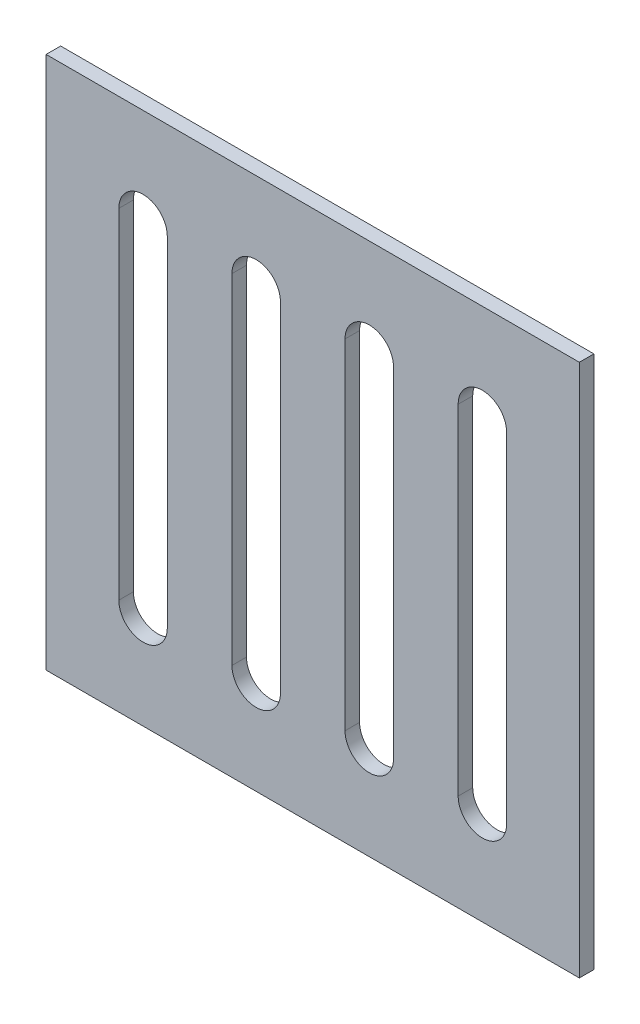
ISO-10303-21;
HEADER;
FILE_DESCRIPTION(('STEP AP214'),'2;1');
FILE_NAME('part.step','',(''),(''),'','','');
FILE_SCHEMA(('AUTOMOTIVE_DESIGN { 1 0 10303 214 1 1 1 1 }'));
ENDSEC;
DATA;
#1=APPLICATION_CONTEXT('core data for automotive mechanical design processes');
#2=APPLICATION_PROTOCOL_DEFINITION('international standard','automotive_design',2000,#1);
#3=PRODUCT_CONTEXT('',#1,'mechanical');
#4=PRODUCT('Part','Part','',(#3));
#5=PRODUCT_RELATED_PRODUCT_CATEGORY('part','',(#4));
#6=PRODUCT_DEFINITION_FORMATION('','',#4);
#7=PRODUCT_DEFINITION_CONTEXT('part definition',#1,'design');
#8=PRODUCT_DEFINITION('design','',#6,#7);
#9=PRODUCT_DEFINITION_SHAPE('','',#8);
#10=(LENGTH_UNIT() NAMED_UNIT(*) SI_UNIT(.MILLI.,.METRE.));
#11=(NAMED_UNIT(*) PLANE_ANGLE_UNIT() SI_UNIT($,.RADIAN.));
#12=(NAMED_UNIT(*) SI_UNIT($,.STERADIAN.) SOLID_ANGLE_UNIT());
#13=UNCERTAINTY_MEASURE_WITH_UNIT(LENGTH_MEASURE(1.E-05),#10,'distance_accuracy_value','');
#14=(GEOMETRIC_REPRESENTATION_CONTEXT(3) GLOBAL_UNCERTAINTY_ASSIGNED_CONTEXT((#13)) GLOBAL_UNIT_ASSIGNED_CONTEXT((#10,
#11,#12)) REPRESENTATION_CONTEXT('',''));
#15=CARTESIAN_POINT('',(0.,0.,0.));
#16=DIRECTION('',(0.,0.,1.));
#17=DIRECTION('',(1.,0.,0.));
#18=AXIS2_PLACEMENT_3D('',#15,#16,#17);
#19=CARTESIAN_POINT('',(0.,0.,3.));
#20=DIRECTION('',(1.,0.,0.));
#21=DIRECTION('',(0.,1.,0.));
#22=AXIS2_PLACEMENT_3D('',#19,#20,#21);
#23=PLANE('',#22);
#24=DIRECTION('',(0.,-1.,0.));
#25=VECTOR('',#24,1.);
#26=CARTESIAN_POINT('',(0.,0.,0.));
#27=LINE('',#26,#25);
#28=CARTESIAN_POINT('',(0.,0.,0.));
#29=VERTEX_POINT('',#28);
#30=CARTESIAN_POINT('',(0.,-110.,0.));
#31=VERTEX_POINT('',#30);
#32=EDGE_CURVE('E211',#29,#31,#27,.T.);
#33=ORIENTED_EDGE('',*,*,#32,.T.);
#34=DIRECTION('',(0.,0.,-1.));
#35=VECTOR('',#34,1.);
#36=CARTESIAN_POINT('',(0.,-110.,3.));
#37=LINE('',#36,#35);
#38=CARTESIAN_POINT('',(0.,-110.,3.));
#39=VERTEX_POINT('',#38);
#40=EDGE_CURVE('E335',#39,#31,#37,.T.);
#41=ORIENTED_EDGE('',*,*,#40,.F.);
#42=DIRECTION('',(0.,-1.,0.));
#43=VECTOR('',#42,1.);
#44=CARTESIAN_POINT('',(0.,0.,3.));
#45=LINE('',#44,#43);
#46=CARTESIAN_POINT('',(0.,0.,3.));
#47=VERTEX_POINT('',#46);
#48=EDGE_CURVE('E298',#47,#39,#45,.T.);
#49=ORIENTED_EDGE('',*,*,#48,.F.);
#50=DIRECTION('',(0.,0.,-1.));
#51=VECTOR('',#50,1.);
#52=CARTESIAN_POINT('',(0.,0.,3.));
#53=LINE('',#52,#51);
#54=EDGE_CURVE('E312',#47,#29,#53,.T.);
#55=ORIENTED_EDGE('',*,*,#54,.T.);
#56=EDGE_LOOP('',(#33,#41,#49,#55));
#57=FACE_BOUND('',#56,.T.);
#58=ADVANCED_FACE('F38',(#57),#23,.F.);
#59=CARTESIAN_POINT('',(0.,-110.,3.));
#60=DIRECTION('',(0.,1.,0.));
#61=DIRECTION('',(0.,0.,1.));
#62=AXIS2_PLACEMENT_3D('',#59,#60,#61);
#63=PLANE('',#62);
#64=DIRECTION('',(1.,0.,0.));
#65=VECTOR('',#64,1.);
#66=CARTESIAN_POINT('',(0.,-110.,0.));
#67=LINE('',#66,#65);
#68=CARTESIAN_POINT('',(110.,-110.,0.));
#69=VERTEX_POINT('',#68);
#70=EDGE_CURVE('E316',#31,#69,#67,.T.);
#71=ORIENTED_EDGE('',*,*,#70,.T.);
#72=DIRECTION('',(0.,0.,-1.));
#73=VECTOR('',#72,1.);
#74=CARTESIAN_POINT('',(110.,-110.,3.));
#75=LINE('',#74,#73);
#76=CARTESIAN_POINT('',(110.,-110.,3.));
#77=VERTEX_POINT('',#76);
#78=EDGE_CURVE('E331',#77,#69,#75,.T.);
#79=ORIENTED_EDGE('',*,*,#78,.F.);
#80=DIRECTION('',(1.,0.,0.));
#81=VECTOR('',#80,1.);
#82=CARTESIAN_POINT('',(0.,-110.,3.));
#83=LINE('',#82,#81);
#84=EDGE_CURVE('E302',#39,#77,#83,.T.);
#85=ORIENTED_EDGE('',*,*,#84,.F.);
#86=ORIENTED_EDGE('',*,*,#40,.T.);
#87=EDGE_LOOP('',(#71,#79,#85,#86));
#88=FACE_BOUND('',#87,.T.);
#89=ADVANCED_FACE('F414',(#88),#63,.F.);
#90=CARTESIAN_POINT('',(110.,0.,3.));
#91=DIRECTION('',(-1.,0.,0.));
#92=DIRECTION('',(0.,-1.,0.));
#93=AXIS2_PLACEMENT_3D('',#90,#91,#92);
#94=PLANE('',#93);
#95=DIRECTION('',(0.,1.,0.));
#96=VECTOR('',#95,1.);
#97=CARTESIAN_POINT('',(110.,0.,0.));
#98=LINE('',#97,#96);
#99=CARTESIAN_POINT('',(110.,0.,0.));
#100=VERTEX_POINT('',#99);
#101=EDGE_CURVE('E319',#69,#100,#98,.T.);
#102=ORIENTED_EDGE('',*,*,#101,.T.);
#103=DIRECTION('',(0.,0.,-1.));
#104=VECTOR('',#103,1.);
#105=CARTESIAN_POINT('',(110.,0.,3.));
#106=LINE('',#105,#104);
#107=CARTESIAN_POINT('',(110.,0.,3.));
#108=VERTEX_POINT('',#107);
#109=EDGE_CURVE('E327',#108,#100,#106,.T.);
#110=ORIENTED_EDGE('',*,*,#109,.F.);
#111=DIRECTION('',(0.,1.,0.));
#112=VECTOR('',#111,1.);
#113=CARTESIAN_POINT('',(110.,0.,3.));
#114=LINE('',#113,#112);
#115=EDGE_CURVE('E306',#77,#108,#114,.T.);
#116=ORIENTED_EDGE('',*,*,#115,.F.);
#117=ORIENTED_EDGE('',*,*,#78,.T.);
#118=EDGE_LOOP('',(#102,#110,#116,#117));
#119=FACE_BOUND('',#118,.T.);
#120=ADVANCED_FACE('F419',(#119),#94,.F.);
#121=CARTESIAN_POINT('',(0.,0.,3.));
#122=DIRECTION('',(0.,-1.,0.));
#123=DIRECTION('',(0.,0.,-1.));
#124=AXIS2_PLACEMENT_3D('',#121,#122,#123);
#125=PLANE('',#124);
#126=DIRECTION('',(-1.,0.,0.));
#127=VECTOR('',#126,1.);
#128=CARTESIAN_POINT('',(0.,0.,0.));
#129=LINE('',#128,#127);
#130=EDGE_CURVE('E303',#100,#29,#129,.T.);
#131=ORIENTED_EDGE('',*,*,#130,.T.);
#132=ORIENTED_EDGE('',*,*,#54,.F.);
#133=DIRECTION('',(-1.,0.,0.));
#134=VECTOR('',#133,1.);
#135=CARTESIAN_POINT('',(0.,0.,3.));
#136=LINE('',#135,#134);
#137=EDGE_CURVE('E309',#108,#47,#136,.T.);
#138=ORIENTED_EDGE('',*,*,#137,.F.);
#139=ORIENTED_EDGE('',*,*,#109,.T.);
#140=EDGE_LOOP('',(#131,#132,#138,#139));
#141=FACE_BOUND('',#140,.T.);
#142=ADVANCED_FACE('F434',(#141),#125,.F.);
#143=CARTESIAN_POINT('',(0.,0.,3.));
#144=DIRECTION('',(0.,0.,1.));
#145=DIRECTION('',(1.,0.,0.));
#146=AXIS2_PLACEMENT_3D('',#143,#144,#145);
#147=PLANE('',#146);
#148=CARTESIAN_POINT('',(20.,-20.,3.));
#149=DIRECTION('',(0.,0.,1.));
#150=DIRECTION('',(1.,0.,0.));
#151=AXIS2_PLACEMENT_3D('',#148,#149,#150);
#152=CIRCLE('',#151,5.);
#153=CARTESIAN_POINT('',(25.,-20.,3.));
#154=VERTEX_POINT('',#153);
#155=CARTESIAN_POINT('',(15.,-20.,3.));
#156=VERTEX_POINT('',#155);
#157=EDGE_CURVE('E53',#154,#156,#152,.T.);
#158=ORIENTED_EDGE('',*,*,#157,.F.);
#159=DIRECTION('',(0.,1.,0.));
#160=VECTOR('',#159,1.);
#161=CARTESIAN_POINT('',(25.,-20.,3.));
#162=LINE('',#161,#160);
#163=CARTESIAN_POINT('',(25.,-90.,3.));
#164=VERTEX_POINT('',#163);
#165=EDGE_CURVE('E201',#164,#154,#162,.T.);
#166=ORIENTED_EDGE('',*,*,#165,.F.);
#167=CARTESIAN_POINT('',(20.,-90.,3.));
#168=DIRECTION('',(0.,0.,1.));
#169=DIRECTION('',(1.,0.,0.));
#170=AXIS2_PLACEMENT_3D('',#167,#168,#169);
#171=CIRCLE('',#170,5.);
#172=CARTESIAN_POINT('',(15.,-90.,3.));
#173=VERTEX_POINT('',#172);
#174=EDGE_CURVE('E182',#173,#164,#171,.T.);
#175=ORIENTED_EDGE('',*,*,#174,.F.);
#176=DIRECTION('',(0.,-1.,0.));
#177=VECTOR('',#176,1.);
#178=CARTESIAN_POINT('',(15.,-20.,3.));
#179=LINE('',#178,#177);
#180=EDGE_CURVE('E193',#156,#173,#179,.T.);
#181=ORIENTED_EDGE('',*,*,#180,.F.);
#182=EDGE_LOOP('',(#158,#166,#175,#181));
#183=FACE_BOUND('',#182,.T.);
#184=CARTESIAN_POINT('',(43.3333333333333,-20.,3.));
#185=DIRECTION('',(0.,0.,1.));
#186=DIRECTION('',(1.,0.,0.));
#187=AXIS2_PLACEMENT_3D('',#184,#185,#186);
#188=CIRCLE('',#187,4.99999999999999);
#189=CARTESIAN_POINT('',(48.3333333333333,-20.,3.));
#190=VERTEX_POINT('',#189);
#191=CARTESIAN_POINT('',(38.3333333333333,-20.,3.));
#192=VERTEX_POINT('',#191);
#193=EDGE_CURVE('E61',#190,#192,#188,.T.);
#194=ORIENTED_EDGE('',*,*,#193,.F.);
#195=DIRECTION('',(0.,1.,0.));
#196=VECTOR('',#195,1.);
#197=CARTESIAN_POINT('',(48.3333333333333,-20.,3.));
#198=LINE('',#197,#196);
#199=CARTESIAN_POINT('',(48.3333333333333,-90.,3.));
#200=VERTEX_POINT('',#199);
#201=EDGE_CURVE('E227',#200,#190,#198,.T.);
#202=ORIENTED_EDGE('',*,*,#201,.F.);
#203=CARTESIAN_POINT('',(43.3333333333333,-90.,3.));
#204=DIRECTION('',(0.,0.,1.));
#205=DIRECTION('',(1.,0.,0.));
#206=AXIS2_PLACEMENT_3D('',#203,#204,#205);
#207=CIRCLE('',#206,4.99999999999999);
#208=CARTESIAN_POINT('',(38.3333333333334,-90.,3.));
#209=VERTEX_POINT('',#208);
#210=EDGE_CURVE('E223',#209,#200,#207,.T.);
#211=ORIENTED_EDGE('',*,*,#210,.F.);
#212=DIRECTION('',(0.,-1.,0.));
#213=VECTOR('',#212,1.);
#214=CARTESIAN_POINT('',(38.3333333333333,-20.,3.));
#215=LINE('',#214,#213);
#216=EDGE_CURVE('E218',#192,#209,#215,.T.);
#217=ORIENTED_EDGE('',*,*,#216,.F.);
#218=EDGE_LOOP('',(#194,#202,#211,#217));
#219=FACE_BOUND('',#218,.T.);
#220=CARTESIAN_POINT('',(66.6666666666667,-20.,3.));
#221=DIRECTION('',(0.,0.,1.));
#222=DIRECTION('',(1.,0.,0.));
#223=AXIS2_PLACEMENT_3D('',#220,#221,#222);
#224=CIRCLE('',#223,5.);
#225=CARTESIAN_POINT('',(71.6666666666667,-20.,3.));
#226=VERTEX_POINT('',#225);
#227=CARTESIAN_POINT('',(61.6666666666667,-20.,3.));
#228=VERTEX_POINT('',#227);
#229=EDGE_CURVE('E243',#226,#228,#224,.T.);
#230=ORIENTED_EDGE('',*,*,#229,.F.);
#231=DIRECTION('',(0.,1.,0.));
#232=VECTOR('',#231,1.);
#233=CARTESIAN_POINT('',(71.6666666666667,-20.,3.));
#234=LINE('',#233,#232);
#235=CARTESIAN_POINT('',(71.6666666666667,-90.,3.));
#236=VERTEX_POINT('',#235);
#237=EDGE_CURVE('E255',#236,#226,#234,.T.);
#238=ORIENTED_EDGE('',*,*,#237,.F.);
#239=CARTESIAN_POINT('',(66.6666666666667,-90.,3.));
#240=DIRECTION('',(0.,0.,1.));
#241=DIRECTION('',(1.,0.,0.));
#242=AXIS2_PLACEMENT_3D('',#239,#240,#241);
#243=CIRCLE('',#242,5.);
#244=CARTESIAN_POINT('',(61.6666666666667,-90.,3.));
#245=VERTEX_POINT('',#244);
#246=EDGE_CURVE('E251',#245,#236,#243,.T.);
#247=ORIENTED_EDGE('',*,*,#246,.F.);
#248=DIRECTION('',(0.,-1.,0.));
#249=VECTOR('',#248,1.);
#250=CARTESIAN_POINT('',(61.6666666666667,-20.,3.));
#251=LINE('',#250,#249);
#252=EDGE_CURVE('E246',#228,#245,#251,.T.);
#253=ORIENTED_EDGE('',*,*,#252,.F.);
#254=EDGE_LOOP('',(#230,#238,#247,#253));
#255=FACE_BOUND('',#254,.T.);
#256=CARTESIAN_POINT('',(90.,-20.,3.));
#257=DIRECTION('',(0.,0.,1.));
#258=DIRECTION('',(1.,0.,0.));
#259=AXIS2_PLACEMENT_3D('',#256,#257,#258);
#260=CIRCLE('',#259,5.);
#261=CARTESIAN_POINT('',(95.,-20.,3.));
#262=VERTEX_POINT('',#261);
#263=CARTESIAN_POINT('',(85.,-20.,3.));
#264=VERTEX_POINT('',#263);
#265=EDGE_CURVE('E271',#262,#264,#260,.T.);
#266=ORIENTED_EDGE('',*,*,#265,.F.);
#267=DIRECTION('',(0.,1.,0.));
#268=VECTOR('',#267,1.);
#269=CARTESIAN_POINT('',(95.,-20.,3.));
#270=LINE('',#269,#268);
#271=CARTESIAN_POINT('',(95.,-90.,3.));
#272=VERTEX_POINT('',#271);
#273=EDGE_CURVE('E282',#272,#262,#270,.T.);
#274=ORIENTED_EDGE('',*,*,#273,.F.);
#275=CARTESIAN_POINT('',(90.,-90.,3.));
#276=DIRECTION('',(0.,0.,1.));
#277=DIRECTION('',(1.,0.,0.));
#278=AXIS2_PLACEMENT_3D('',#275,#276,#277);
#279=CIRCLE('',#278,5.);
#280=CARTESIAN_POINT('',(85.,-90.,3.));
#281=VERTEX_POINT('',#280);
#282=EDGE_CURVE('E278',#281,#272,#279,.T.);
#283=ORIENTED_EDGE('',*,*,#282,.F.);
#284=DIRECTION('',(0.,-1.,0.));
#285=VECTOR('',#284,1.);
#286=CARTESIAN_POINT('',(85.,-20.,3.));
#287=LINE('',#286,#285);
#288=EDGE_CURVE('E274',#264,#281,#287,.T.);
#289=ORIENTED_EDGE('',*,*,#288,.F.);
#290=EDGE_LOOP('',(#266,#274,#283,#289));
#291=FACE_BOUND('',#290,.T.);
#292=ORIENTED_EDGE('',*,*,#48,.T.);
#293=ORIENTED_EDGE('',*,*,#84,.T.);
#294=ORIENTED_EDGE('',*,*,#115,.T.);
#295=ORIENTED_EDGE('',*,*,#137,.T.);
#296=EDGE_LOOP('',(#292,#293,#294,#295));
#297=FACE_BOUND('',#296,.T.);
#298=ADVANCED_FACE('F198',(#183,#219,#255,#291,#297),#147,.T.);
#299=CARTESIAN_POINT('',(0.,0.,0.));
#300=DIRECTION('',(0.,0.,1.));
#301=DIRECTION('',(1.,0.,0.));
#302=AXIS2_PLACEMENT_3D('',#299,#300,#301);
#303=PLANE('',#302);
#304=DIRECTION('',(0.,1.,0.));
#305=VECTOR('',#304,1.);
#306=CARTESIAN_POINT('',(25.,0.,0.));
#307=LINE('',#306,#305);
#308=CARTESIAN_POINT('',(25.,-90.,0.));
#309=VERTEX_POINT('',#308);
#310=CARTESIAN_POINT('',(25.,-20.,0.));
#311=VERTEX_POINT('',#310);
#312=EDGE_CURVE('E46',#309,#311,#307,.T.);
#313=ORIENTED_EDGE('',*,*,#312,.T.);
#314=CARTESIAN_POINT('',(20.,-20.,0.));
#315=DIRECTION('',(0.,0.,1.));
#316=DIRECTION('',(1.,0.,0.));
#317=AXIS2_PLACEMENT_3D('',#314,#315,#316);
#318=CIRCLE('',#317,5.);
#319=CARTESIAN_POINT('',(15.,-20.,0.));
#320=VERTEX_POINT('',#319);
#321=EDGE_CURVE('E11',#311,#320,#318,.T.);
#322=ORIENTED_EDGE('',*,*,#321,.T.);
#323=DIRECTION('',(0.,-1.,0.));
#324=VECTOR('',#323,1.);
#325=CARTESIAN_POINT('',(15.,0.,0.));
#326=LINE('',#325,#324);
#327=CARTESIAN_POINT('',(15.,-90.,0.));
#328=VERTEX_POINT('',#327);
#329=EDGE_CURVE('E387',#320,#328,#326,.T.);
#330=ORIENTED_EDGE('',*,*,#329,.T.);
#331=CARTESIAN_POINT('',(20.,-90.,0.));
#332=DIRECTION('',(0.,0.,1.));
#333=DIRECTION('',(1.,0.,0.));
#334=AXIS2_PLACEMENT_3D('',#331,#332,#333);
#335=CIRCLE('',#334,5.);
#336=EDGE_CURVE('E185',#328,#309,#335,.T.);
#337=ORIENTED_EDGE('',*,*,#336,.T.);
#338=EDGE_LOOP('',(#313,#322,#330,#337));
#339=FACE_BOUND('',#338,.T.);
#340=DIRECTION('',(0.,1.,0.));
#341=VECTOR('',#340,1.);
#342=CARTESIAN_POINT('',(48.3333333333333,0.,0.));
#343=LINE('',#342,#341);
#344=CARTESIAN_POINT('',(48.3333333333333,-90.,0.));
#345=VERTEX_POINT('',#344);
#346=CARTESIAN_POINT('',(48.3333333333333,-20.,0.));
#347=VERTEX_POINT('',#346);
#348=EDGE_CURVE('E379',#345,#347,#343,.T.);
#349=ORIENTED_EDGE('',*,*,#348,.T.);
#350=CARTESIAN_POINT('',(43.3333333333333,-20.,0.));
#351=DIRECTION('',(0.,0.,1.));
#352=DIRECTION('',(1.,0.,0.));
#353=AXIS2_PLACEMENT_3D('',#350,#351,#352);
#354=CIRCLE('',#353,4.99999999999999);
#355=CARTESIAN_POINT('',(38.3333333333333,-20.,0.));
#356=VERTEX_POINT('',#355);
#357=EDGE_CURVE('E383',#347,#356,#354,.T.);
#358=ORIENTED_EDGE('',*,*,#357,.T.);
#359=DIRECTION('',(0.,-1.,0.));
#360=VECTOR('',#359,1.);
#361=CARTESIAN_POINT('',(38.3333333333333,0.,0.));
#362=LINE('',#361,#360);
#363=CARTESIAN_POINT('',(38.3333333333333,-90.,0.));
#364=VERTEX_POINT('',#363);
#365=EDGE_CURVE('E371',#356,#364,#362,.T.);
#366=ORIENTED_EDGE('',*,*,#365,.T.);
#367=CARTESIAN_POINT('',(43.3333333333333,-90.,0.));
#368=DIRECTION('',(0.,0.,1.));
#369=DIRECTION('',(1.,0.,0.));
#370=AXIS2_PLACEMENT_3D('',#367,#368,#369);
#371=CIRCLE('',#370,4.99999999999999);
#372=EDGE_CURVE('E375',#364,#345,#371,.T.);
#373=ORIENTED_EDGE('',*,*,#372,.T.);
#374=EDGE_LOOP('',(#349,#358,#366,#373));
#375=FACE_BOUND('',#374,.T.);
#376=DIRECTION('',(0.,1.,0.));
#377=VECTOR('',#376,1.);
#378=CARTESIAN_POINT('',(71.6666666666667,0.,0.));
#379=LINE('',#378,#377);
#380=CARTESIAN_POINT('',(71.6666666666667,-90.,0.));
#381=VERTEX_POINT('',#380);
#382=CARTESIAN_POINT('',(71.6666666666667,-20.,0.));
#383=VERTEX_POINT('',#382);
#384=EDGE_CURVE('E363',#381,#383,#379,.T.);
#385=ORIENTED_EDGE('',*,*,#384,.T.);
#386=CARTESIAN_POINT('',(66.6666666666667,-20.,0.));
#387=DIRECTION('',(0.,0.,1.));
#388=DIRECTION('',(1.,0.,0.));
#389=AXIS2_PLACEMENT_3D('',#386,#387,#388);
#390=CIRCLE('',#389,5.);
#391=CARTESIAN_POINT('',(61.6666666666667,-20.,0.));
#392=VERTEX_POINT('',#391);
#393=EDGE_CURVE('E367',#383,#392,#390,.T.);
#394=ORIENTED_EDGE('',*,*,#393,.T.);
#395=DIRECTION('',(0.,-1.,0.));
#396=VECTOR('',#395,1.);
#397=CARTESIAN_POINT('',(61.6666666666667,0.,0.));
#398=LINE('',#397,#396);
#399=CARTESIAN_POINT('',(61.6666666666667,-90.,0.));
#400=VERTEX_POINT('',#399);
#401=EDGE_CURVE('E355',#392,#400,#398,.T.);
#402=ORIENTED_EDGE('',*,*,#401,.T.);
#403=CARTESIAN_POINT('',(66.6666666666667,-90.,0.));
#404=DIRECTION('',(0.,0.,1.));
#405=DIRECTION('',(1.,0.,0.));
#406=AXIS2_PLACEMENT_3D('',#403,#404,#405);
#407=CIRCLE('',#406,5.);
#408=EDGE_CURVE('E359',#400,#381,#407,.T.);
#409=ORIENTED_EDGE('',*,*,#408,.T.);
#410=EDGE_LOOP('',(#385,#394,#402,#409));
#411=FACE_BOUND('',#410,.T.);
#412=DIRECTION('',(0.,1.,0.));
#413=VECTOR('',#412,1.);
#414=CARTESIAN_POINT('',(95.,0.,0.));
#415=LINE('',#414,#413);
#416=CARTESIAN_POINT('',(95.,-90.,0.));
#417=VERTEX_POINT('',#416);
#418=CARTESIAN_POINT('',(95.,-20.,0.));
#419=VERTEX_POINT('',#418);
#420=EDGE_CURVE('E347',#417,#419,#415,.T.);
#421=ORIENTED_EDGE('',*,*,#420,.T.);
#422=CARTESIAN_POINT('',(90.,-20.,0.));
#423=DIRECTION('',(0.,0.,1.));
#424=DIRECTION('',(1.,0.,0.));
#425=AXIS2_PLACEMENT_3D('',#422,#423,#424);
#426=CIRCLE('',#425,5.);
#427=CARTESIAN_POINT('',(85.,-20.,0.));
#428=VERTEX_POINT('',#427);
#429=EDGE_CURVE('E351',#419,#428,#426,.T.);
#430=ORIENTED_EDGE('',*,*,#429,.T.);
#431=DIRECTION('',(0.,-1.,0.));
#432=VECTOR('',#431,1.);
#433=CARTESIAN_POINT('',(85.,0.,0.));
#434=LINE('',#433,#432);
#435=CARTESIAN_POINT('',(85.,-90.,0.));
#436=VERTEX_POINT('',#435);
#437=EDGE_CURVE('E339',#428,#436,#434,.T.);
#438=ORIENTED_EDGE('',*,*,#437,.T.);
#439=CARTESIAN_POINT('',(90.,-90.,0.));
#440=DIRECTION('',(0.,0.,1.));
#441=DIRECTION('',(1.,0.,0.));
#442=AXIS2_PLACEMENT_3D('',#439,#440,#441);
#443=CIRCLE('',#442,5.);
#444=EDGE_CURVE('E343',#436,#417,#443,.T.);
#445=ORIENTED_EDGE('',*,*,#444,.T.);
#446=EDGE_LOOP('',(#421,#430,#438,#445));
#447=FACE_BOUND('',#446,.T.);
#448=ORIENTED_EDGE('',*,*,#32,.F.);
#449=ORIENTED_EDGE('',*,*,#130,.F.);
#450=ORIENTED_EDGE('',*,*,#101,.F.);
#451=ORIENTED_EDGE('',*,*,#70,.F.);
#452=EDGE_LOOP('',(#448,#449,#450,#451));
#453=FACE_BOUND('',#452,.T.);
#454=ADVANCED_FACE('F394',(#339,#375,#411,#447,#453),#303,.F.);
#455=CARTESIAN_POINT('',(90.,-20.,-7.));
#456=DIRECTION('',(0.,0.,1.));
#457=DIRECTION('',(1.,0.,0.));
#458=AXIS2_PLACEMENT_3D('',#455,#456,#457);
#459=CYLINDRICAL_SURFACE('',#458,5.);
#460=DIRECTION('',(0.,0.,1.));
#461=VECTOR('',#460,1.);
#462=CARTESIAN_POINT('',(95.,-20.,-7.));
#463=LINE('',#462,#461);
#464=EDGE_CURVE('E247',#419,#262,#463,.T.);
#465=ORIENTED_EDGE('',*,*,#464,.T.);
#466=ORIENTED_EDGE('',*,*,#265,.T.);
#467=DIRECTION('',(0.,0.,1.));
#468=VECTOR('',#467,1.);
#469=CARTESIAN_POINT('',(85.,-20.,-7.));
#470=LINE('',#469,#468);
#471=EDGE_CURVE('E286',#428,#264,#470,.T.);
#472=ORIENTED_EDGE('',*,*,#471,.F.);
#473=ORIENTED_EDGE('',*,*,#429,.F.);
#474=EDGE_LOOP('',(#465,#466,#472,#473));
#475=FACE_BOUND('',#474,.T.);
#476=ADVANCED_FACE('F445',(#475),#459,.F.);
#477=CARTESIAN_POINT('',(95.,-20.,-7.));
#478=DIRECTION('',(1.,0.,0.));
#479=DIRECTION('',(0.,0.,-1.));
#480=AXIS2_PLACEMENT_3D('',#477,#478,#479);
#481=PLANE('',#480);
#482=DIRECTION('',(0.,0.,1.));
#483=VECTOR('',#482,1.);
#484=CARTESIAN_POINT('',(95.,-90.,-7.));
#485=LINE('',#484,#483);
#486=EDGE_CURVE('E289',#417,#272,#485,.T.);
#487=ORIENTED_EDGE('',*,*,#486,.T.);
#488=ORIENTED_EDGE('',*,*,#273,.T.);
#489=ORIENTED_EDGE('',*,*,#464,.F.);
#490=ORIENTED_EDGE('',*,*,#420,.F.);
#491=EDGE_LOOP('',(#487,#488,#489,#490));
#492=FACE_BOUND('',#491,.T.);
#493=ADVANCED_FACE('F450',(#492),#481,.F.);
#494=CARTESIAN_POINT('',(90.,-90.,-7.));
#495=DIRECTION('',(0.,0.,1.));
#496=DIRECTION('',(1.,0.,0.));
#497=AXIS2_PLACEMENT_3D('',#494,#495,#496);
#498=CYLINDRICAL_SURFACE('',#497,5.);
#499=DIRECTION('',(0.,0.,1.));
#500=VECTOR('',#499,1.);
#501=CARTESIAN_POINT('',(85.,-90.,-7.));
#502=LINE('',#501,#500);
#503=EDGE_CURVE('E292',#436,#281,#502,.T.);
#504=ORIENTED_EDGE('',*,*,#503,.T.);
#505=ORIENTED_EDGE('',*,*,#282,.T.);
#506=ORIENTED_EDGE('',*,*,#486,.F.);
#507=ORIENTED_EDGE('',*,*,#444,.F.);
#508=EDGE_LOOP('',(#504,#505,#506,#507));
#509=FACE_BOUND('',#508,.T.);
#510=ADVANCED_FACE('F456',(#509),#498,.F.);
#511=CARTESIAN_POINT('',(85.,-20.,-7.));
#512=DIRECTION('',(-1.,0.,0.));
#513=DIRECTION('',(0.,0.,1.));
#514=AXIS2_PLACEMENT_3D('',#511,#512,#513);
#515=PLANE('',#514);
#516=ORIENTED_EDGE('',*,*,#471,.T.);
#517=ORIENTED_EDGE('',*,*,#288,.T.);
#518=ORIENTED_EDGE('',*,*,#503,.F.);
#519=ORIENTED_EDGE('',*,*,#437,.F.);
#520=EDGE_LOOP('',(#516,#517,#518,#519));
#521=FACE_BOUND('',#520,.T.);
#522=ADVANCED_FACE('F452',(#521),#515,.F.);
#523=CARTESIAN_POINT('',(66.6666666666667,-20.,-7.));
#524=DIRECTION('',(0.,0.,1.));
#525=DIRECTION('',(1.,0.,0.));
#526=AXIS2_PLACEMENT_3D('',#523,#524,#525);
#527=CYLINDRICAL_SURFACE('',#526,5.);
#528=DIRECTION('',(0.,0.,1.));
#529=VECTOR('',#528,1.);
#530=CARTESIAN_POINT('',(71.6666666666667,-20.,-7.));
#531=LINE('',#530,#529);
#532=EDGE_CURVE('E219',#383,#226,#531,.T.);
#533=ORIENTED_EDGE('',*,*,#532,.T.);
#534=ORIENTED_EDGE('',*,*,#229,.T.);
#535=DIRECTION('',(0.,0.,1.));
#536=VECTOR('',#535,1.);
#537=CARTESIAN_POINT('',(61.6666666666667,-20.,-7.));
#538=LINE('',#537,#536);
#539=EDGE_CURVE('E259',#392,#228,#538,.T.);
#540=ORIENTED_EDGE('',*,*,#539,.F.);
#541=ORIENTED_EDGE('',*,*,#393,.F.);
#542=EDGE_LOOP('',(#533,#534,#540,#541));
#543=FACE_BOUND('',#542,.T.);
#544=ADVANCED_FACE('F455',(#543),#527,.F.);
#545=CARTESIAN_POINT('',(71.6666666666667,-20.,-7.));
#546=DIRECTION('',(1.,0.,0.));
#547=DIRECTION('',(0.,0.,-1.));
#548=AXIS2_PLACEMENT_3D('',#545,#546,#547);
#549=PLANE('',#548);
#550=DIRECTION('',(0.,0.,1.));
#551=VECTOR('',#550,1.);
#552=CARTESIAN_POINT('',(71.6666666666667,-90.,-7.));
#553=LINE('',#552,#551);
#554=EDGE_CURVE('E262',#381,#236,#553,.T.);
#555=ORIENTED_EDGE('',*,*,#554,.T.);
#556=ORIENTED_EDGE('',*,*,#237,.T.);
#557=ORIENTED_EDGE('',*,*,#532,.F.);
#558=ORIENTED_EDGE('',*,*,#384,.F.);
#559=EDGE_LOOP('',(#555,#556,#557,#558));
#560=FACE_BOUND('',#559,.T.);
#561=ADVANCED_FACE('F466',(#560),#549,.F.);
#562=CARTESIAN_POINT('',(66.6666666666667,-90.,-7.));
#563=DIRECTION('',(0.,0.,1.));
#564=DIRECTION('',(1.,0.,0.));
#565=AXIS2_PLACEMENT_3D('',#562,#563,#564);
#566=CYLINDRICAL_SURFACE('',#565,5.);
#567=DIRECTION('',(0.,0.,1.));
#568=VECTOR('',#567,1.);
#569=CARTESIAN_POINT('',(61.6666666666667,-90.,-7.));
#570=LINE('',#569,#568);
#571=EDGE_CURVE('E265',#400,#245,#570,.T.);
#572=ORIENTED_EDGE('',*,*,#571,.T.);
#573=ORIENTED_EDGE('',*,*,#246,.T.);
#574=ORIENTED_EDGE('',*,*,#554,.F.);
#575=ORIENTED_EDGE('',*,*,#408,.F.);
#576=EDGE_LOOP('',(#572,#573,#574,#575));
#577=FACE_BOUND('',#576,.T.);
#578=ADVANCED_FACE('F472',(#577),#566,.F.);
#579=CARTESIAN_POINT('',(61.6666666666667,-20.,-7.));
#580=DIRECTION('',(-1.,0.,0.));
#581=DIRECTION('',(0.,0.,1.));
#582=AXIS2_PLACEMENT_3D('',#579,#580,#581);
#583=PLANE('',#582);
#584=ORIENTED_EDGE('',*,*,#539,.T.);
#585=ORIENTED_EDGE('',*,*,#252,.T.);
#586=ORIENTED_EDGE('',*,*,#571,.F.);
#587=ORIENTED_EDGE('',*,*,#401,.F.);
#588=EDGE_LOOP('',(#584,#585,#586,#587));
#589=FACE_BOUND('',#588,.T.);
#590=ADVANCED_FACE('F468',(#589),#583,.F.);
#591=CARTESIAN_POINT('',(43.3333333333333,-20.,-7.));
#592=DIRECTION('',(0.,0.,1.));
#593=DIRECTION('',(1.,0.,0.));
#594=AXIS2_PLACEMENT_3D('',#591,#592,#593);
#595=CYLINDRICAL_SURFACE('',#594,4.99999999999999);
#596=DIRECTION('',(0.,0.,1.));
#597=VECTOR('',#596,1.);
#598=CARTESIAN_POINT('',(48.3333333333333,-20.,-7.));
#599=LINE('',#598,#597);
#600=EDGE_CURVE('E232',#347,#190,#599,.T.);
#601=ORIENTED_EDGE('',*,*,#600,.T.);
#602=ORIENTED_EDGE('',*,*,#193,.T.);
#603=DIRECTION('',(0.,0.,1.));
#604=VECTOR('',#603,1.);
#605=CARTESIAN_POINT('',(38.3333333333333,-20.,-7.));
#606=LINE('',#605,#604);
#607=EDGE_CURVE('E231',#356,#192,#606,.T.);
#608=ORIENTED_EDGE('',*,*,#607,.F.);
#609=ORIENTED_EDGE('',*,*,#357,.F.);
#610=EDGE_LOOP('',(#601,#602,#608,#609));
#611=FACE_BOUND('',#610,.T.);
#612=ADVANCED_FACE('F471',(#611),#595,.F.);
#613=CARTESIAN_POINT('',(48.3333333333333,-20.,-7.));
#614=DIRECTION('',(1.,0.,0.));
#615=DIRECTION('',(0.,0.,-1.));
#616=AXIS2_PLACEMENT_3D('',#613,#614,#615);
#617=PLANE('',#616);
#618=DIRECTION('',(0.,0.,1.));
#619=VECTOR('',#618,1.);
#620=CARTESIAN_POINT('',(48.3333333333333,-90.,-7.));
#621=LINE('',#620,#619);
#622=EDGE_CURVE('E235',#345,#200,#621,.T.);
#623=ORIENTED_EDGE('',*,*,#622,.T.);
#624=ORIENTED_EDGE('',*,*,#201,.T.);
#625=ORIENTED_EDGE('',*,*,#600,.F.);
#626=ORIENTED_EDGE('',*,*,#348,.F.);
#627=EDGE_LOOP('',(#623,#624,#625,#626));
#628=FACE_BOUND('',#627,.T.);
#629=ADVANCED_FACE('F481',(#628),#617,.F.);
#630=CARTESIAN_POINT('',(43.3333333333333,-90.,-7.));
#631=DIRECTION('',(0.,0.,1.));
#632=DIRECTION('',(1.,0.,0.));
#633=AXIS2_PLACEMENT_3D('',#630,#631,#632);
#634=CYLINDRICAL_SURFACE('',#633,4.99999999999999);
#635=DIRECTION('',(0.,0.,1.));
#636=VECTOR('',#635,1.);
#637=CARTESIAN_POINT('',(38.3333333333334,-90.,-7.));
#638=LINE('',#637,#636);
#639=EDGE_CURVE('E238',#364,#209,#638,.T.);
#640=ORIENTED_EDGE('',*,*,#639,.T.);
#641=ORIENTED_EDGE('',*,*,#210,.T.);
#642=ORIENTED_EDGE('',*,*,#622,.F.);
#643=ORIENTED_EDGE('',*,*,#372,.F.);
#644=EDGE_LOOP('',(#640,#641,#642,#643));
#645=FACE_BOUND('',#644,.T.);
#646=ADVANCED_FACE('F408',(#645),#634,.F.);
#647=CARTESIAN_POINT('',(38.3333333333333,-20.,-7.));
#648=DIRECTION('',(-1.,0.,0.));
#649=DIRECTION('',(0.,0.,1.));
#650=AXIS2_PLACEMENT_3D('',#647,#648,#649);
#651=PLANE('',#650);
#652=ORIENTED_EDGE('',*,*,#607,.T.);
#653=ORIENTED_EDGE('',*,*,#216,.T.);
#654=ORIENTED_EDGE('',*,*,#639,.F.);
#655=ORIENTED_EDGE('',*,*,#365,.F.);
#656=EDGE_LOOP('',(#652,#653,#654,#655));
#657=FACE_BOUND('',#656,.T.);
#658=ADVANCED_FACE('F401',(#657),#651,.F.);
#659=CARTESIAN_POINT('',(20.,-20.,-7.));
#660=DIRECTION('',(0.,0.,1.));
#661=DIRECTION('',(1.,0.,0.));
#662=AXIS2_PLACEMENT_3D('',#659,#660,#661);
#663=CYLINDRICAL_SURFACE('',#662,5.);
#664=DIRECTION('',(0.,0.,1.));
#665=VECTOR('',#664,1.);
#666=CARTESIAN_POINT('',(25.,-20.,-7.));
#667=LINE('',#666,#665);
#668=EDGE_CURVE('E208',#311,#154,#667,.T.);
#669=ORIENTED_EDGE('',*,*,#668,.T.);
#670=ORIENTED_EDGE('',*,*,#157,.T.);
#671=DIRECTION('',(0.,0.,1.));
#672=VECTOR('',#671,1.);
#673=CARTESIAN_POINT('',(15.,-20.,-7.));
#674=LINE('',#673,#672);
#675=EDGE_CURVE('E190',#320,#156,#674,.T.);
#676=ORIENTED_EDGE('',*,*,#675,.F.);
#677=ORIENTED_EDGE('',*,*,#321,.F.);
#678=EDGE_LOOP('',(#669,#670,#676,#677));
#679=FACE_BOUND('',#678,.T.);
#680=ADVANCED_FACE('F399',(#679),#663,.F.);
#681=CARTESIAN_POINT('',(25.,-20.,-7.));
#682=DIRECTION('',(1.,0.,0.));
#683=DIRECTION('',(0.,0.,-1.));
#684=AXIS2_PLACEMENT_3D('',#681,#682,#683);
#685=PLANE('',#684);
#686=DIRECTION('',(0.,0.,1.));
#687=VECTOR('',#686,1.);
#688=CARTESIAN_POINT('',(25.,-90.,-7.));
#689=LINE('',#688,#687);
#690=EDGE_CURVE('E189',#309,#164,#689,.T.);
#691=ORIENTED_EDGE('',*,*,#690,.T.);
#692=ORIENTED_EDGE('',*,*,#165,.T.);
#693=ORIENTED_EDGE('',*,*,#668,.F.);
#694=ORIENTED_EDGE('',*,*,#312,.F.);
#695=EDGE_LOOP('',(#691,#692,#693,#694));
#696=FACE_BOUND('',#695,.T.);
#697=ADVANCED_FACE('F398',(#696),#685,.F.);
#698=CARTESIAN_POINT('',(20.,-90.,-7.));
#699=DIRECTION('',(0.,0.,1.));
#700=DIRECTION('',(1.,0.,0.));
#701=AXIS2_PLACEMENT_3D('',#698,#699,#700);
#702=CYLINDRICAL_SURFACE('',#701,5.);
#703=DIRECTION('',(0.,0.,1.));
#704=VECTOR('',#703,1.);
#705=CARTESIAN_POINT('',(15.,-90.,-7.));
#706=LINE('',#705,#704);
#707=EDGE_CURVE('E177',#328,#173,#706,.T.);
#708=ORIENTED_EDGE('',*,*,#707,.T.);
#709=ORIENTED_EDGE('',*,*,#174,.T.);
#710=ORIENTED_EDGE('',*,*,#690,.F.);
#711=ORIENTED_EDGE('',*,*,#336,.F.);
#712=EDGE_LOOP('',(#708,#709,#710,#711));
#713=FACE_BOUND('',#712,.T.);
#714=ADVANCED_FACE('F179',(#713),#702,.F.);
#715=CARTESIAN_POINT('',(15.,-20.,-7.));
#716=DIRECTION('',(-1.,0.,0.));
#717=DIRECTION('',(0.,0.,1.));
#718=AXIS2_PLACEMENT_3D('',#715,#716,#717);
#719=PLANE('',#718);
#720=ORIENTED_EDGE('',*,*,#675,.T.);
#721=ORIENTED_EDGE('',*,*,#180,.T.);
#722=ORIENTED_EDGE('',*,*,#707,.F.);
#723=ORIENTED_EDGE('',*,*,#329,.F.);
#724=EDGE_LOOP('',(#720,#721,#722,#723));
#725=FACE_BOUND('',#724,.T.);
#726=ADVANCED_FACE('F194',(#725),#719,.F.);
#727=CLOSED_SHELL('',(#58,#89,#120,#142,#298,#454,#476,#493,#510,#522,#544,#561,#578,#590,#612,
#629,#646,#658,#680,#697,#714,#726));
#728=MANIFOLD_SOLID_BREP('B2',#727);
#729=ADVANCED_BREP_SHAPE_REPRESENTATION('',(#18,#728),#14);
#730=SHAPE_DEFINITION_REPRESENTATION(#9,#729);
ENDSEC;
END-ISO-10303-21;
